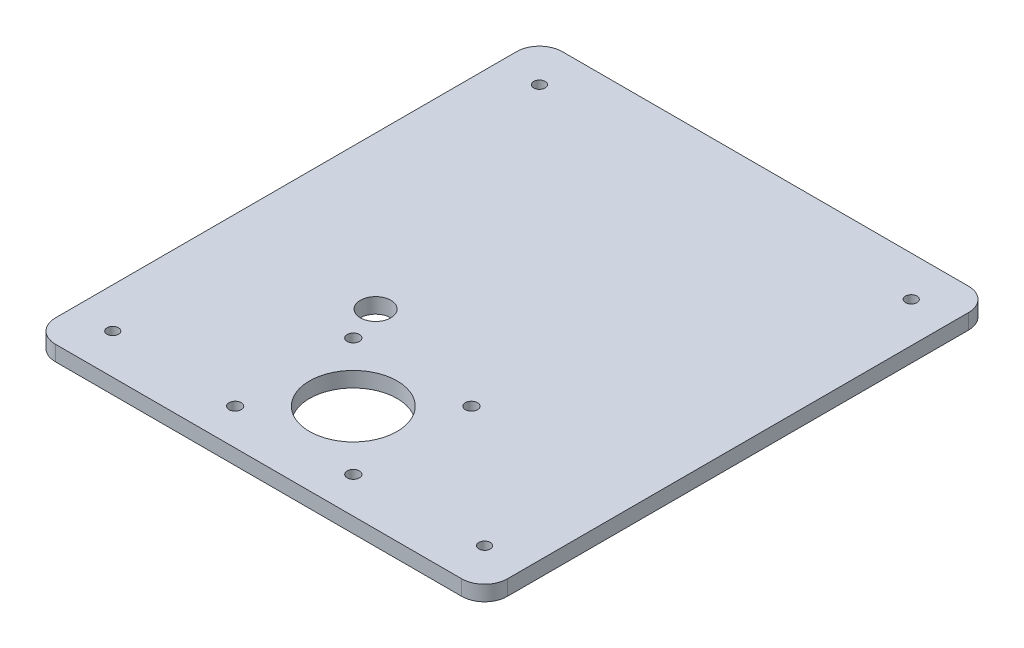
ISO-10303-21;
HEADER;
FILE_DESCRIPTION(('STEP AP214'),'2;1');
FILE_NAME('part.step','',(''),(''),'','','');
FILE_SCHEMA(('AUTOMOTIVE_DESIGN { 1 0 10303 214 1 1 1 1 }'));
ENDSEC;
DATA;
#1=APPLICATION_CONTEXT('core data for automotive mechanical design processes');
#2=APPLICATION_PROTOCOL_DEFINITION('international standard','automotive_design',2000,#1);
#3=PRODUCT_CONTEXT('',#1,'mechanical');
#4=PRODUCT('Part','Part','',(#3));
#5=PRODUCT_RELATED_PRODUCT_CATEGORY('part','',(#4));
#6=PRODUCT_DEFINITION_FORMATION('','',#4);
#7=PRODUCT_DEFINITION_CONTEXT('part definition',#1,'design');
#8=PRODUCT_DEFINITION('design','',#6,#7);
#9=PRODUCT_DEFINITION_SHAPE('','',#8);
#10=(LENGTH_UNIT() NAMED_UNIT(*) SI_UNIT(.MILLI.,.METRE.));
#11=(NAMED_UNIT(*) PLANE_ANGLE_UNIT() SI_UNIT($,.RADIAN.));
#12=(NAMED_UNIT(*) SI_UNIT($,.STERADIAN.) SOLID_ANGLE_UNIT());
#13=UNCERTAINTY_MEASURE_WITH_UNIT(LENGTH_MEASURE(1.E-05),#10,'distance_accuracy_value','');
#14=(GEOMETRIC_REPRESENTATION_CONTEXT(3) GLOBAL_UNCERTAINTY_ASSIGNED_CONTEXT((#13)) GLOBAL_UNIT_ASSIGNED_CONTEXT((#10,
#11,#12)) REPRESENTATION_CONTEXT('',''));
#15=CARTESIAN_POINT('',(0.,0.,0.));
#16=DIRECTION('',(0.,0.,1.));
#17=DIRECTION('',(1.,0.,0.));
#18=AXIS2_PLACEMENT_3D('',#15,#16,#17);
#19=CARTESIAN_POINT('',(111.074334450702,53.3961892872808,202.069099258539));
#20=DIRECTION('',(0.,-1.,0.));
#21=DIRECTION('',(0.,0.,-1.));
#22=AXIS2_PLACEMENT_3D('',#19,#20,#21);
#23=PLANE('',#22);
#24=CARTESIAN_POINT('',(38.4779917164948,53.3961892872808,158.072756524331));
#25=DIRECTION('',(0.,-1.,0.));
#26=DIRECTION('',(0.,0.,-1.));
#27=AXIS2_PLACEMENT_3D('',#24,#25,#26);
#28=CIRCLE('',#27,4.00000000000001);
#29=CARTESIAN_POINT('',(38.4779917164948,53.3961892872808,154.072756524331));
#30=VERTEX_POINT('',#29);
#31=EDGE_CURVE('E755',#30,#30,#28,.T.);
#32=ORIENTED_EDGE('',*,*,#31,.F.);
#33=EDGE_LOOP('',(#32));
#34=FACE_BOUND('',#33,.T.);
#35=CARTESIAN_POINT('',(53.9779917164948,53.3961892872808,161.572756524331));
#36=DIRECTION('',(0.,-1.,0.));
#37=DIRECTION('',(0.,0.,-1.));
#38=AXIS2_PLACEMENT_3D('',#35,#36,#37);
#39=CIRCLE('',#38,3.);
#40=CARTESIAN_POINT('',(53.9779917164948,53.3961892872808,164.572756524331));
#41=VERTEX_POINT('',#40);
#42=CARTESIAN_POINT('',(50.9779917164948,53.3961892872808,161.572756524331));
#43=VERTEX_POINT('',#42);
#44=EDGE_CURVE('E234',#41,#43,#39,.T.);
#45=ORIENTED_EDGE('',*,*,#44,.F.);
#46=DIRECTION('',(-1.,0.,0.));
#47=VECTOR('',#46,1.);
#48=CARTESIAN_POINT('',(111.074334450702,53.3961892872808,164.572756524331));
#49=LINE('',#48,#47);
#50=CARTESIAN_POINT('',(60.9779917164948,53.3961892872808,164.572756524331));
#51=VERTEX_POINT('',#50);
#52=EDGE_CURVE('E11',#41,#51,#49,.F.);
#53=ORIENTED_EDGE('',*,*,#52,.T.);
#54=CARTESIAN_POINT('',(60.9779917164948,53.3961892872808,161.572756524331));
#55=DIRECTION('',(0.,-1.,0.));
#56=DIRECTION('',(0.,0.,-1.));
#57=AXIS2_PLACEMENT_3D('',#54,#55,#56);
#58=CIRCLE('',#57,3.);
#59=CARTESIAN_POINT('',(63.9779917164948,53.3961892872808,161.572756524331));
#60=VERTEX_POINT('',#59);
#61=EDGE_CURVE('E42',#60,#51,#58,.T.);
#62=ORIENTED_EDGE('',*,*,#61,.F.);
#63=DIRECTION('',(0.,0.,1.));
#64=VECTOR('',#63,1.);
#65=CARTESIAN_POINT('',(63.9779917164948,53.3961892872808,202.069099258538));
#66=LINE('',#65,#64);
#67=CARTESIAN_POINT('',(63.9779917164948,53.3961892872808,134.572756524331));
#68=VERTEX_POINT('',#67);
#69=EDGE_CURVE('E247',#60,#68,#66,.F.);
#70=ORIENTED_EDGE('',*,*,#69,.T.);
#71=CARTESIAN_POINT('',(60.9779917164948,53.3961892872808,134.572756524331));
#72=DIRECTION('',(0.,-1.,0.));
#73=DIRECTION('',(0.,0.,-1.));
#74=AXIS2_PLACEMENT_3D('',#71,#72,#73);
#75=CIRCLE('',#74,3.);
#76=CARTESIAN_POINT('',(60.9779917164948,53.3961892872808,131.572756524331));
#77=VERTEX_POINT('',#76);
#78=EDGE_CURVE('E244',#77,#68,#75,.T.);
#79=ORIENTED_EDGE('',*,*,#78,.F.);
#80=DIRECTION('',(1.,0.,0.));
#81=VECTOR('',#80,1.);
#82=CARTESIAN_POINT('',(111.074334450702,53.3961892872808,131.572756524331));
#83=LINE('',#82,#81);
#84=CARTESIAN_POINT('',(53.9779917164948,53.3961892872808,131.572756524331));
#85=VERTEX_POINT('',#84);
#86=EDGE_CURVE('E242',#77,#85,#83,.F.);
#87=ORIENTED_EDGE('',*,*,#86,.T.);
#88=CARTESIAN_POINT('',(53.9779917164948,53.3961892872808,134.572756524331));
#89=DIRECTION('',(0.,-1.,0.));
#90=DIRECTION('',(0.,0.,-1.));
#91=AXIS2_PLACEMENT_3D('',#88,#89,#90);
#92=CIRCLE('',#91,3.);
#93=CARTESIAN_POINT('',(50.9779917164948,53.3961892872808,134.572756524331));
#94=VERTEX_POINT('',#93);
#95=EDGE_CURVE('E239',#94,#85,#92,.T.);
#96=ORIENTED_EDGE('',*,*,#95,.F.);
#97=DIRECTION('',(0.,0.,-1.));
#98=VECTOR('',#97,1.);
#99=CARTESIAN_POINT('',(50.9779917164948,53.3961892872808,202.069099258538));
#100=LINE('',#99,#98);
#101=EDGE_CURVE('E237',#94,#43,#100,.F.);
#102=ORIENTED_EDGE('',*,*,#101,.T.);
#103=EDGE_LOOP('',(#45,#53,#62,#70,#79,#87,#96,#102));
#104=FACE_BOUND('',#103,.T.);
#105=CARTESIAN_POINT('',(106.561867680193,53.3961892872808,197.556632488029));
#106=DIRECTION('',(0.,-1.,0.));
#107=DIRECTION('',(0.,0.,-1.));
#108=AXIS2_PLACEMENT_3D('',#105,#106,#107);
#109=CIRCLE('',#108,1.5);
#110=CARTESIAN_POINT('',(106.561867680193,53.3961892872808,196.056632488029));
#111=VERTEX_POINT('',#110);
#112=EDGE_CURVE('E312',#111,#111,#109,.T.);
#113=ORIENTED_EDGE('',*,*,#112,.F.);
#114=EDGE_LOOP('',(#113));
#115=FACE_BOUND('',#114,.T.);
#116=CARTESIAN_POINT('',(8.99411575279711,53.3961892872808,85.5888805606337));
#117=DIRECTION('',(0.,-1.,0.));
#118=DIRECTION('',(0.,0.,-1.));
#119=AXIS2_PLACEMENT_3D('',#116,#117,#118);
#120=CIRCLE('',#119,1.5);
#121=CARTESIAN_POINT('',(8.99411575279711,53.3961892872808,84.0888805606337));
#122=VERTEX_POINT('',#121);
#123=EDGE_CURVE('E311',#122,#122,#120,.T.);
#124=ORIENTED_EDGE('',*,*,#123,.F.);
#125=EDGE_LOOP('',(#124));
#126=FACE_BOUND('',#125,.T.);
#127=CARTESIAN_POINT('',(106.561867680193,53.3961892872808,85.5888805606337));
#128=DIRECTION('',(0.,-1.,0.));
#129=DIRECTION('',(0.,0.,-1.));
#130=AXIS2_PLACEMENT_3D('',#127,#128,#129);
#131=CIRCLE('',#130,1.5);
#132=CARTESIAN_POINT('',(106.561867680193,53.3961892872808,84.0888805606337));
#133=VERTEX_POINT('',#132);
#134=EDGE_CURVE('E305',#133,#133,#131,.T.);
#135=ORIENTED_EDGE('',*,*,#134,.F.);
#136=EDGE_LOOP('',(#135));
#137=FACE_BOUND('',#136,.T.);
#138=CARTESIAN_POINT('',(8.99411575279711,53.3961892872808,197.556632488029));
#139=DIRECTION('',(0.,-1.,0.));
#140=DIRECTION('',(0.,0.,-1.));
#141=AXIS2_PLACEMENT_3D('',#138,#139,#140);
#142=CIRCLE('',#141,1.5);
#143=CARTESIAN_POINT('',(8.99411575279711,53.3961892872808,196.056632488029));
#144=VERTEX_POINT('',#143);
#145=EDGE_CURVE('E319',#144,#144,#142,.T.);
#146=ORIENTED_EDGE('',*,*,#145,.F.);
#147=EDGE_LOOP('',(#146));
#148=FACE_BOUND('',#147,.T.);
#149=CARTESIAN_POINT('',(73.1312084616623,53.3961892872808,167.571537435734));
#150=DIRECTION('',(0.,-1.,0.));
#151=DIRECTION('',(0.,0.,-1.));
#152=AXIS2_PLACEMENT_3D('',#149,#150,#151);
#153=CIRCLE('',#152,1.59999999999999);
#154=CARTESIAN_POINT('',(73.1312084616623,53.3961892872808,165.971537435734));
#155=VERTEX_POINT('',#154);
#156=EDGE_CURVE('E329',#155,#155,#153,.T.);
#157=ORIENTED_EDGE('',*,*,#156,.F.);
#158=EDGE_LOOP('',(#157));
#159=FACE_BOUND('',#158,.T.);
#160=CARTESIAN_POINT('',(42.1312084616623,53.3961892872808,167.571537435734));
#161=DIRECTION('',(0.,-1.,0.));
#162=DIRECTION('',(0.,0.,-1.));
#163=AXIS2_PLACEMENT_3D('',#160,#161,#162);
#164=CIRCLE('',#163,1.59999999999999);
#165=CARTESIAN_POINT('',(42.1312084616623,53.3961892872808,165.971537435734));
#166=VERTEX_POINT('',#165);
#167=EDGE_CURVE('E344',#166,#166,#164,.T.);
#168=ORIENTED_EDGE('',*,*,#167,.F.);
#169=EDGE_LOOP('',(#168));
#170=FACE_BOUND('',#169,.T.);
#171=CARTESIAN_POINT('',(42.1312084616623,53.3961892872808,198.571537435734));
#172=DIRECTION('',(0.,-1.,0.));
#173=DIRECTION('',(0.,0.,-1.));
#174=AXIS2_PLACEMENT_3D('',#171,#172,#173);
#175=CIRCLE('',#174,1.59999999999999);
#176=CARTESIAN_POINT('',(42.1312084616623,53.3961892872808,196.971537435734));
#177=VERTEX_POINT('',#176);
#178=EDGE_CURVE('E338',#177,#177,#175,.T.);
#179=ORIENTED_EDGE('',*,*,#178,.F.);
#180=EDGE_LOOP('',(#179));
#181=FACE_BOUND('',#180,.T.);
#182=CARTESIAN_POINT('',(73.1312084616623,53.3961892872808,198.571537435734));
#183=DIRECTION('',(0.,-1.,0.));
#184=DIRECTION('',(0.,0.,-1.));
#185=AXIS2_PLACEMENT_3D('',#182,#183,#184);
#186=CIRCLE('',#185,1.59999999999999);
#187=CARTESIAN_POINT('',(73.1312084616623,53.3961892872808,196.971537435734));
#188=VERTEX_POINT('',#187);
#189=EDGE_CURVE('E330',#188,#188,#186,.T.);
#190=ORIENTED_EDGE('',*,*,#189,.F.);
#191=EDGE_LOOP('',(#190));
#192=FACE_BOUND('',#191,.T.);
#193=CARTESIAN_POINT('',(57.6312084616623,53.3961892872808,183.071537465536));
#194=DIRECTION('',(0.,-1.,0.));
#195=DIRECTION('',(0.,0.,-1.));
#196=AXIS2_PLACEMENT_3D('',#193,#194,#195);
#197=CIRCLE('',#196,11.5);
#198=CARTESIAN_POINT('',(57.6312084616623,53.3961892872808,171.571537465536));
#199=VERTEX_POINT('',#198);
#200=EDGE_CURVE('E337',#199,#199,#197,.T.);
#201=ORIENTED_EDGE('',*,*,#200,.F.);
#202=EDGE_LOOP('',(#201));
#203=FACE_BOUND('',#202,.T.);
#204=CARTESIAN_POINT('',(111.074334450702,53.3961892872808,202.069099258539));
#205=DIRECTION('',(0.,-1.,0.));
#206=DIRECTION('',(0.707106781186549,0.,0.707106781186546));
#207=AXIS2_PLACEMENT_3D('',#204,#205,#206);
#208=ELLIPSE('',#207,6.00731230503429,6.00000000000001);
#209=CARTESIAN_POINT('',(117.077991716495,53.3961892872808,202.076411562217));
#210=VERTEX_POINT('',#209);
#211=CARTESIAN_POINT('',(111.08164675438,53.3961892872808,208.072756524331));
#212=VERTEX_POINT('',#211);
#213=EDGE_CURVE('E183',#210,#212,#208,.T.);
#214=ORIENTED_EDGE('',*,*,#213,.T.);
#215=DIRECTION('',(-1.,0.,0.));
#216=VECTOR('',#215,1.);
#217=CARTESIAN_POINT('',(4.47433667860937,53.3961892872808,208.072756524331));
#218=LINE('',#217,#216);
#219=CARTESIAN_POINT('',(4.47433667860937,53.3961892872808,208.072756524331));
#220=VERTEX_POINT('',#219);
#221=EDGE_CURVE('E172',#212,#220,#218,.T.);
#222=ORIENTED_EDGE('',*,*,#221,.T.);
#223=CARTESIAN_POINT('',(4.48164898228774,53.3961892872808,202.069099258539));
#224=DIRECTION('',(0.,-1.,0.));
#225=DIRECTION('',(-0.707106781186548,0.,0.707106781186547));
#226=AXIS2_PLACEMENT_3D('',#223,#224,#225);
#227=ELLIPSE('',#226,6.00731230503429,6.00000000000001);
#228=CARTESIAN_POINT('',(-1.5220082835052,53.3961892872808,202.076411562217));
#229=VERTEX_POINT('',#228);
#230=EDGE_CURVE('E182',#220,#229,#227,.T.);
#231=ORIENTED_EDGE('',*,*,#230,.T.);
#232=DIRECTION('',(0.,0.,-1.));
#233=VECTOR('',#232,1.);
#234=CARTESIAN_POINT('',(-1.5220082835052,53.3961892872808,81.069101486446));
#235=LINE('',#234,#233);
#236=CARTESIAN_POINT('',(-1.5220082835052,53.3961892872808,81.069101486446));
#237=VERTEX_POINT('',#236);
#238=EDGE_CURVE('E476',#229,#237,#235,.T.);
#239=ORIENTED_EDGE('',*,*,#238,.T.);
#240=CARTESIAN_POINT('',(4.48164898228774,53.3961892872808,81.0764137901244));
#241=DIRECTION('',(0.,-1.,0.));
#242=DIRECTION('',(-0.707106781186547,0.,-0.707106781186548));
#243=AXIS2_PLACEMENT_3D('',#240,#241,#242);
#244=ELLIPSE('',#243,6.0073123050343,6.);
#245=CARTESIAN_POINT('',(4.47433667860938,53.3961892872808,75.0727565243314));
#246=VERTEX_POINT('',#245);
#247=EDGE_CURVE('E491',#237,#246,#244,.T.);
#248=ORIENTED_EDGE('',*,*,#247,.T.);
#249=DIRECTION('',(1.,0.,0.));
#250=VECTOR('',#249,1.);
#251=CARTESIAN_POINT('',(111.08164675438,53.3961892872808,75.0727565243314));
#252=LINE('',#251,#250);
#253=CARTESIAN_POINT('',(111.08164675438,53.3961892872808,75.0727565243314));
#254=VERTEX_POINT('',#253);
#255=EDGE_CURVE('E439',#246,#254,#252,.T.);
#256=ORIENTED_EDGE('',*,*,#255,.T.);
#257=CARTESIAN_POINT('',(111.074334450702,53.3961892872808,81.0764137901244));
#258=DIRECTION('',(0.,-1.,0.));
#259=DIRECTION('',(0.707106781186548,0.,-0.707106781186548));
#260=AXIS2_PLACEMENT_3D('',#257,#258,#259);
#261=ELLIPSE('',#260,6.0073123050343,6.);
#262=CARTESIAN_POINT('',(117.077991716495,53.3961892872808,81.069101486446));
#263=VERTEX_POINT('',#262);
#264=EDGE_CURVE('E435',#254,#263,#261,.T.);
#265=ORIENTED_EDGE('',*,*,#264,.T.);
#266=DIRECTION('',(0.,0.,1.));
#267=VECTOR('',#266,1.);
#268=CARTESIAN_POINT('',(117.077991716495,53.3961892872808,202.076411562217));
#269=LINE('',#268,#267);
#270=EDGE_CURVE('E187',#263,#210,#269,.T.);
#271=ORIENTED_EDGE('',*,*,#270,.T.);
#272=EDGE_LOOP('',(#214,#222,#231,#239,#248,#256,#265,#271));
#273=FACE_BOUND('',#272,.T.);
#274=ADVANCED_FACE('F33',(#34,#104,#115,#126,#137,#148,#159,#170,#181,#192,#203,#273),#23,.T.);
#275=DIRECTION('',(0.,1.,0.));
#276=VECTOR('',#275,1.);
#277=SURFACE_OF_LINEAR_EXTRUSION('',#208,#276);
#278=CARTESIAN_POINT('',(111.074334450702,57.3961892872808,202.069099258539));
#279=DIRECTION('',(0.,-1.,0.));
#280=DIRECTION('',(0.707106781186549,0.,0.707106781186546));
#281=AXIS2_PLACEMENT_3D('',#278,#279,#280);
#282=ELLIPSE('',#281,6.00731230503429,6.00000000000001);
#283=CARTESIAN_POINT('',(117.077991716495,57.3961892872808,202.076411562217));
#284=VERTEX_POINT('',#283);
#285=CARTESIAN_POINT('',(111.08164675438,57.3961892872808,208.072756524331));
#286=VERTEX_POINT('',#285);
#287=EDGE_CURVE('E195',#284,#286,#282,.T.);
#288=ORIENTED_EDGE('',*,*,#287,.T.);
#289=DIRECTION('',(0.,1.,0.));
#290=VECTOR('',#289,1.);
#291=CARTESIAN_POINT('',(111.08164675438,53.3961892872808,208.072756524331));
#292=LINE('',#291,#290);
#293=EDGE_CURVE('E176',#212,#286,#292,.T.);
#294=ORIENTED_EDGE('',*,*,#293,.F.);
#295=ORIENTED_EDGE('',*,*,#213,.F.);
#296=DIRECTION('',(0.,1.,0.));
#297=VECTOR('',#296,1.);
#298=CARTESIAN_POINT('',(117.077991716495,53.3961892872808,202.076411562217));
#299=LINE('',#298,#297);
#300=EDGE_CURVE('E442',#210,#284,#299,.T.);
#301=ORIENTED_EDGE('',*,*,#300,.T.);
#302=EDGE_LOOP('',(#288,#294,#295,#301));
#303=FACE_BOUND('',#302,.T.);
#304=ADVANCED_FACE('F193',(#303),#277,.F.);
#305=CARTESIAN_POINT('',(4.47433667860937,53.3961892872808,208.072756524331));
#306=DIRECTION('',(0.,0.,-1.));
#307=DIRECTION('',(-1.,0.,0.));
#308=AXIS2_PLACEMENT_3D('',#305,#306,#307);
#309=PLANE('',#308);
#310=DIRECTION('',(-1.,0.,0.));
#311=VECTOR('',#310,1.);
#312=CARTESIAN_POINT('',(4.47433667860937,57.3961892872808,208.072756524331));
#313=LINE('',#312,#311);
#314=CARTESIAN_POINT('',(4.47433667860937,57.3961892872808,208.072756524331));
#315=VERTEX_POINT('',#314);
#316=EDGE_CURVE('E444',#286,#315,#313,.T.);
#317=ORIENTED_EDGE('',*,*,#316,.T.);
#318=DIRECTION('',(0.,1.,0.));
#319=VECTOR('',#318,1.);
#320=CARTESIAN_POINT('',(4.47433667860937,53.3961892872808,208.072756524331));
#321=LINE('',#320,#319);
#322=EDGE_CURVE('E179',#220,#315,#321,.T.);
#323=ORIENTED_EDGE('',*,*,#322,.F.);
#324=ORIENTED_EDGE('',*,*,#221,.F.);
#325=ORIENTED_EDGE('',*,*,#293,.T.);
#326=EDGE_LOOP('',(#317,#323,#324,#325));
#327=FACE_BOUND('',#326,.T.);
#328=ADVANCED_FACE('F174',(#327),#309,.F.);
#329=DIRECTION('',(0.,1.,0.));
#330=VECTOR('',#329,1.);
#331=SURFACE_OF_LINEAR_EXTRUSION('',#227,#330);
#332=CARTESIAN_POINT('',(4.48164898228774,57.3961892872808,202.069099258539));
#333=DIRECTION('',(0.,-1.,0.));
#334=DIRECTION('',(-0.707106781186548,0.,0.707106781186547));
#335=AXIS2_PLACEMENT_3D('',#332,#333,#334);
#336=ELLIPSE('',#335,6.00731230503429,6.00000000000001);
#337=CARTESIAN_POINT('',(-1.5220082835052,57.3961892872808,202.076411562217));
#338=VERTEX_POINT('',#337);
#339=EDGE_CURVE('E446',#315,#338,#336,.T.);
#340=ORIENTED_EDGE('',*,*,#339,.T.);
#341=DIRECTION('',(0.,1.,0.));
#342=VECTOR('',#341,1.);
#343=CARTESIAN_POINT('',(-1.5220082835052,53.3961892872808,202.076411562217));
#344=LINE('',#343,#342);
#345=EDGE_CURVE('E200',#229,#338,#344,.T.);
#346=ORIENTED_EDGE('',*,*,#345,.F.);
#347=ORIENTED_EDGE('',*,*,#230,.F.);
#348=ORIENTED_EDGE('',*,*,#322,.T.);
#349=EDGE_LOOP('',(#340,#346,#347,#348));
#350=FACE_BOUND('',#349,.T.);
#351=ADVANCED_FACE('F497',(#350),#331,.F.);
#352=CARTESIAN_POINT('',(-1.5220082835052,53.3961892872808,81.069101486446));
#353=DIRECTION('',(1.,0.,0.));
#354=DIRECTION('',(0.,0.,-1.));
#355=AXIS2_PLACEMENT_3D('',#352,#353,#354);
#356=PLANE('',#355);
#357=DIRECTION('',(0.,0.,-1.));
#358=VECTOR('',#357,1.);
#359=CARTESIAN_POINT('',(-1.5220082835052,57.3961892872808,81.069101486446));
#360=LINE('',#359,#358);
#361=CARTESIAN_POINT('',(-1.5220082835052,57.3961892872808,81.069101486446));
#362=VERTEX_POINT('',#361);
#363=EDGE_CURVE('E448',#338,#362,#360,.T.);
#364=ORIENTED_EDGE('',*,*,#363,.T.);
#365=DIRECTION('',(0.,1.,0.));
#366=VECTOR('',#365,1.);
#367=CARTESIAN_POINT('',(-1.5220082835052,53.3961892872808,81.069101486446));
#368=LINE('',#367,#366);
#369=EDGE_CURVE('E467',#237,#362,#368,.T.);
#370=ORIENTED_EDGE('',*,*,#369,.F.);
#371=ORIENTED_EDGE('',*,*,#238,.F.);
#372=ORIENTED_EDGE('',*,*,#345,.T.);
#373=EDGE_LOOP('',(#364,#370,#371,#372));
#374=FACE_BOUND('',#373,.T.);
#375=ADVANCED_FACE('F474',(#374),#356,.F.);
#376=DIRECTION('',(0.,1.,0.));
#377=VECTOR('',#376,1.);
#378=SURFACE_OF_LINEAR_EXTRUSION('',#244,#377);
#379=CARTESIAN_POINT('',(4.48164898228774,57.3961892872808,81.0764137901244));
#380=DIRECTION('',(0.,-1.,0.));
#381=DIRECTION('',(-0.707106781186547,0.,-0.707106781186548));
#382=AXIS2_PLACEMENT_3D('',#379,#380,#381);
#383=ELLIPSE('',#382,6.0073123050343,6.);
#384=CARTESIAN_POINT('',(4.47433667860938,57.3961892872808,75.0727565243314));
#385=VERTEX_POINT('',#384);
#386=EDGE_CURVE('E450',#362,#385,#383,.T.);
#387=ORIENTED_EDGE('',*,*,#386,.T.);
#388=DIRECTION('',(0.,1.,0.));
#389=VECTOR('',#388,1.);
#390=CARTESIAN_POINT('',(4.47433667860938,53.3961892872808,75.0727565243314));
#391=LINE('',#390,#389);
#392=EDGE_CURVE('E464',#246,#385,#391,.T.);
#393=ORIENTED_EDGE('',*,*,#392,.F.);
#394=ORIENTED_EDGE('',*,*,#247,.F.);
#395=ORIENTED_EDGE('',*,*,#369,.T.);
#396=EDGE_LOOP('',(#387,#393,#394,#395));
#397=FACE_BOUND('',#396,.T.);
#398=ADVANCED_FACE('F485',(#397),#378,.F.);
#399=CARTESIAN_POINT('',(111.08164675438,53.3961892872808,75.0727565243314));
#400=DIRECTION('',(0.,0.,1.));
#401=DIRECTION('',(1.,0.,0.));
#402=AXIS2_PLACEMENT_3D('',#399,#400,#401);
#403=PLANE('',#402);
#404=DIRECTION('',(1.,0.,0.));
#405=VECTOR('',#404,1.);
#406=CARTESIAN_POINT('',(111.08164675438,57.3961892872808,75.0727565243314));
#407=LINE('',#406,#405);
#408=CARTESIAN_POINT('',(111.08164675438,57.3961892872808,75.0727565243314));
#409=VERTEX_POINT('',#408);
#410=EDGE_CURVE('E452',#385,#409,#407,.T.);
#411=ORIENTED_EDGE('',*,*,#410,.T.);
#412=DIRECTION('',(0.,1.,0.));
#413=VECTOR('',#412,1.);
#414=CARTESIAN_POINT('',(111.08164675438,53.3961892872808,75.0727565243314));
#415=LINE('',#414,#413);
#416=EDGE_CURVE('E461',#254,#409,#415,.T.);
#417=ORIENTED_EDGE('',*,*,#416,.F.);
#418=ORIENTED_EDGE('',*,*,#255,.F.);
#419=ORIENTED_EDGE('',*,*,#392,.T.);
#420=EDGE_LOOP('',(#411,#417,#418,#419));
#421=FACE_BOUND('',#420,.T.);
#422=ADVANCED_FACE('F432',(#421),#403,.F.);
#423=DIRECTION('',(0.,1.,0.));
#424=VECTOR('',#423,1.);
#425=SURFACE_OF_LINEAR_EXTRUSION('',#261,#424);
#426=CARTESIAN_POINT('',(111.074334450702,57.3961892872808,81.0764137901244));
#427=DIRECTION('',(0.,-1.,0.));
#428=DIRECTION('',(0.707106781186548,0.,-0.707106781186548));
#429=AXIS2_PLACEMENT_3D('',#426,#427,#428);
#430=ELLIPSE('',#429,6.0073123050343,6.);
#431=CARTESIAN_POINT('',(117.077991716495,57.3961892872808,81.069101486446));
#432=VERTEX_POINT('',#431);
#433=EDGE_CURVE('E454',#409,#432,#430,.T.);
#434=ORIENTED_EDGE('',*,*,#433,.T.);
#435=DIRECTION('',(0.,1.,0.));
#436=VECTOR('',#435,1.);
#437=CARTESIAN_POINT('',(117.077991716495,53.3961892872808,81.069101486446));
#438=LINE('',#437,#436);
#439=EDGE_CURVE('E458',#263,#432,#438,.T.);
#440=ORIENTED_EDGE('',*,*,#439,.F.);
#441=ORIENTED_EDGE('',*,*,#264,.F.);
#442=ORIENTED_EDGE('',*,*,#416,.T.);
#443=EDGE_LOOP('',(#434,#440,#441,#442));
#444=FACE_BOUND('',#443,.T.);
#445=ADVANCED_FACE('F427',(#444),#425,.F.);
#446=CARTESIAN_POINT('',(117.077991716495,53.3961892872808,202.076411562217));
#447=DIRECTION('',(-1.,0.,0.));
#448=DIRECTION('',(0.,0.,1.));
#449=AXIS2_PLACEMENT_3D('',#446,#447,#448);
#450=PLANE('',#449);
#451=DIRECTION('',(0.,0.,1.));
#452=VECTOR('',#451,1.);
#453=CARTESIAN_POINT('',(117.077991716495,57.3961892872808,202.076411562217));
#454=LINE('',#453,#452);
#455=EDGE_CURVE('E191',#432,#284,#454,.T.);
#456=ORIENTED_EDGE('',*,*,#455,.T.);
#457=ORIENTED_EDGE('',*,*,#300,.F.);
#458=ORIENTED_EDGE('',*,*,#270,.F.);
#459=ORIENTED_EDGE('',*,*,#439,.T.);
#460=EDGE_LOOP('',(#456,#457,#458,#459));
#461=FACE_BOUND('',#460,.T.);
#462=ADVANCED_FACE('F423',(#461),#450,.F.);
#463=CARTESIAN_POINT('',(111.074334450702,57.3961892872808,202.069099258539));
#464=DIRECTION('',(0.,-1.,0.));
#465=DIRECTION('',(0.,0.,-1.));
#466=AXIS2_PLACEMENT_3D('',#463,#464,#465);
#467=PLANE('',#466);
#468=CARTESIAN_POINT('',(38.4779917164948,57.3961892872808,158.072756524331));
#469=DIRECTION('',(0.,-1.,0.));
#470=DIRECTION('',(0.,0.,-1.));
#471=AXIS2_PLACEMENT_3D('',#468,#469,#470);
#472=CIRCLE('',#471,4.00000000000001);
#473=CARTESIAN_POINT('',(38.4779917164948,57.3961892872808,154.072756524331));
#474=VERTEX_POINT('',#473);
#475=EDGE_CURVE('E253',#474,#474,#472,.F.);
#476=ORIENTED_EDGE('',*,*,#475,.F.);
#477=EDGE_LOOP('',(#476));
#478=FACE_BOUND('',#477,.T.);
#479=CARTESIAN_POINT('',(106.561867680193,57.3961892872808,197.556632488029));
#480=DIRECTION('',(0.,-1.,0.));
#481=DIRECTION('',(0.,0.,-1.));
#482=AXIS2_PLACEMENT_3D('',#479,#480,#481);
#483=CIRCLE('',#482,1.5);
#484=CARTESIAN_POINT('',(106.561867680193,57.3961892872808,196.056632488029));
#485=VERTEX_POINT('',#484);
#486=EDGE_CURVE('E315',#485,#485,#483,.F.);
#487=ORIENTED_EDGE('',*,*,#486,.F.);
#488=EDGE_LOOP('',(#487));
#489=FACE_BOUND('',#488,.T.);
#490=CARTESIAN_POINT('',(8.99411575279711,57.3961892872808,85.5888805606337));
#491=DIRECTION('',(0.,-1.,0.));
#492=DIRECTION('',(0.,0.,-1.));
#493=AXIS2_PLACEMENT_3D('',#490,#491,#492);
#494=CIRCLE('',#493,1.5);
#495=CARTESIAN_POINT('',(8.99411575279711,57.3961892872808,84.0888805606337));
#496=VERTEX_POINT('',#495);
#497=EDGE_CURVE('E316',#496,#496,#494,.F.);
#498=ORIENTED_EDGE('',*,*,#497,.F.);
#499=EDGE_LOOP('',(#498));
#500=FACE_BOUND('',#499,.T.);
#501=CARTESIAN_POINT('',(106.561867680193,57.3961892872808,85.5888805606337));
#502=DIRECTION('',(0.,-1.,0.));
#503=DIRECTION('',(0.,0.,-1.));
#504=AXIS2_PLACEMENT_3D('',#501,#502,#503);
#505=CIRCLE('',#504,1.5);
#506=CARTESIAN_POINT('',(106.561867680193,57.3961892872808,84.0888805606337));
#507=VERTEX_POINT('',#506);
#508=EDGE_CURVE('E308',#507,#507,#505,.F.);
#509=ORIENTED_EDGE('',*,*,#508,.F.);
#510=EDGE_LOOP('',(#509));
#511=FACE_BOUND('',#510,.T.);
#512=CARTESIAN_POINT('',(8.99411575279711,57.3961892872808,197.556632488029));
#513=DIRECTION('',(0.,-1.,0.));
#514=DIRECTION('',(0.,0.,-1.));
#515=AXIS2_PLACEMENT_3D('',#512,#513,#514);
#516=CIRCLE('',#515,1.5);
#517=CARTESIAN_POINT('',(8.99411575279711,57.3961892872808,196.056632488029));
#518=VERTEX_POINT('',#517);
#519=EDGE_CURVE('E326',#518,#518,#516,.F.);
#520=ORIENTED_EDGE('',*,*,#519,.F.);
#521=EDGE_LOOP('',(#520));
#522=FACE_BOUND('',#521,.T.);
#523=CARTESIAN_POINT('',(73.1312084616623,57.3961892872808,167.571537435734));
#524=DIRECTION('',(0.,-1.,0.));
#525=DIRECTION('',(0.,0.,-1.));
#526=AXIS2_PLACEMENT_3D('',#523,#524,#525);
#527=CIRCLE('',#526,1.59999999999999);
#528=CARTESIAN_POINT('',(73.1312084616623,57.3961892872808,165.971537435734));
#529=VERTEX_POINT('',#528);
#530=EDGE_CURVE('E347',#529,#529,#527,.F.);
#531=ORIENTED_EDGE('',*,*,#530,.F.);
#532=EDGE_LOOP('',(#531));
#533=FACE_BOUND('',#532,.T.);
#534=CARTESIAN_POINT('',(42.1312084616623,57.3961892872808,167.571537435734));
#535=DIRECTION('',(0.,-1.,0.));
#536=DIRECTION('',(0.,0.,-1.));
#537=AXIS2_PLACEMENT_3D('',#534,#535,#536);
#538=CIRCLE('',#537,1.59999999999999);
#539=CARTESIAN_POINT('',(42.1312084616623,57.3961892872808,165.971537435734));
#540=VERTEX_POINT('',#539);
#541=EDGE_CURVE('E341',#540,#540,#538,.F.);
#542=ORIENTED_EDGE('',*,*,#541,.F.);
#543=EDGE_LOOP('',(#542));
#544=FACE_BOUND('',#543,.T.);
#545=CARTESIAN_POINT('',(42.1312084616623,57.3961892872808,198.571537435734));
#546=DIRECTION('',(0.,-1.,0.));
#547=DIRECTION('',(0.,0.,-1.));
#548=AXIS2_PLACEMENT_3D('',#545,#546,#547);
#549=CIRCLE('',#548,1.59999999999999);
#550=CARTESIAN_POINT('',(42.1312084616623,57.3961892872808,196.971537435734));
#551=VERTEX_POINT('',#550);
#552=EDGE_CURVE('E334',#551,#551,#549,.F.);
#553=ORIENTED_EDGE('',*,*,#552,.F.);
#554=EDGE_LOOP('',(#553));
#555=FACE_BOUND('',#554,.T.);
#556=CARTESIAN_POINT('',(73.1312084616623,57.3961892872808,198.571537435734));
#557=DIRECTION('',(0.,-1.,0.));
#558=DIRECTION('',(0.,0.,-1.));
#559=AXIS2_PLACEMENT_3D('',#556,#557,#558);
#560=CIRCLE('',#559,1.59999999999999);
#561=CARTESIAN_POINT('',(73.1312084616623,57.3961892872808,196.971537435734));
#562=VERTEX_POINT('',#561);
#563=EDGE_CURVE('E333',#562,#562,#560,.F.);
#564=ORIENTED_EDGE('',*,*,#563,.F.);
#565=EDGE_LOOP('',(#564));
#566=FACE_BOUND('',#565,.T.);
#567=CARTESIAN_POINT('',(57.6312084616623,57.3961892872808,183.071537465536));
#568=DIRECTION('',(0.,-1.,0.));
#569=DIRECTION('',(0.,0.,-1.));
#570=AXIS2_PLACEMENT_3D('',#567,#568,#569);
#571=CIRCLE('',#570,11.5);
#572=CARTESIAN_POINT('',(57.6312084616623,57.3961892872808,171.571537465536));
#573=VERTEX_POINT('',#572);
#574=EDGE_CURVE('E356',#573,#573,#571,.F.);
#575=ORIENTED_EDGE('',*,*,#574,.F.);
#576=EDGE_LOOP('',(#575));
#577=FACE_BOUND('',#576,.T.);
#578=ORIENTED_EDGE('',*,*,#287,.F.);
#579=ORIENTED_EDGE('',*,*,#455,.F.);
#580=ORIENTED_EDGE('',*,*,#433,.F.);
#581=ORIENTED_EDGE('',*,*,#410,.F.);
#582=ORIENTED_EDGE('',*,*,#386,.F.);
#583=ORIENTED_EDGE('',*,*,#363,.F.);
#584=ORIENTED_EDGE('',*,*,#339,.F.);
#585=ORIENTED_EDGE('',*,*,#316,.F.);
#586=EDGE_LOOP('',(#578,#579,#580,#581,#582,#583,#584,#585));
#587=FACE_BOUND('',#586,.T.);
#588=ADVANCED_FACE('F420',(#478,#489,#500,#511,#522,#533,#544,#555,#566,#577,#587),#467,.F.);
#589=CARTESIAN_POINT('',(57.6312084616623,57.3971892872808,183.071537465536));
#590=DIRECTION('',(0.,-1.,0.));
#591=DIRECTION('',(0.,0.,-1.));
#592=AXIS2_PLACEMENT_3D('',#589,#590,#591);
#593=CYLINDRICAL_SURFACE('',#592,11.5);
#594=ORIENTED_EDGE('',*,*,#200,.T.);
#595=EDGE_LOOP('',(#594));
#596=FACE_BOUND('',#595,.T.);
#597=ORIENTED_EDGE('',*,*,#574,.T.);
#598=EDGE_LOOP('',(#597));
#599=FACE_BOUND('',#598,.T.);
#600=ADVANCED_FACE('F418',(#596,#599),#593,.F.);
#601=CARTESIAN_POINT('',(73.1312084616623,57.3971892872808,198.571537435734));
#602=DIRECTION('',(0.,-1.,0.));
#603=DIRECTION('',(0.,0.,-1.));
#604=AXIS2_PLACEMENT_3D('',#601,#602,#603);
#605=CYLINDRICAL_SURFACE('',#604,1.59999999999999);
#606=ORIENTED_EDGE('',*,*,#189,.T.);
#607=EDGE_LOOP('',(#606));
#608=FACE_BOUND('',#607,.T.);
#609=ORIENTED_EDGE('',*,*,#563,.T.);
#610=EDGE_LOOP('',(#609));
#611=FACE_BOUND('',#610,.T.);
#612=ADVANCED_FACE('F557',(#608,#611),#605,.F.);
#613=CARTESIAN_POINT('',(42.1312084616623,57.3971892872808,198.571537435734));
#614=DIRECTION('',(0.,-1.,0.));
#615=DIRECTION('',(0.,0.,-1.));
#616=AXIS2_PLACEMENT_3D('',#613,#614,#615);
#617=CYLINDRICAL_SURFACE('',#616,1.59999999999999);
#618=ORIENTED_EDGE('',*,*,#178,.T.);
#619=EDGE_LOOP('',(#618));
#620=FACE_BOUND('',#619,.T.);
#621=ORIENTED_EDGE('',*,*,#552,.T.);
#622=EDGE_LOOP('',(#621));
#623=FACE_BOUND('',#622,.T.);
#624=ADVANCED_FACE('F565',(#620,#623),#617,.F.);
#625=CARTESIAN_POINT('',(42.1312084616623,57.3971892872808,167.571537435734));
#626=DIRECTION('',(0.,-1.,0.));
#627=DIRECTION('',(0.,0.,-1.));
#628=AXIS2_PLACEMENT_3D('',#625,#626,#627);
#629=CYLINDRICAL_SURFACE('',#628,1.59999999999999);
#630=ORIENTED_EDGE('',*,*,#167,.T.);
#631=EDGE_LOOP('',(#630));
#632=FACE_BOUND('',#631,.T.);
#633=ORIENTED_EDGE('',*,*,#541,.T.);
#634=EDGE_LOOP('',(#633));
#635=FACE_BOUND('',#634,.T.);
#636=ADVANCED_FACE('F574',(#632,#635),#629,.F.);
#637=CARTESIAN_POINT('',(73.1312084616623,57.3971892872808,167.571537435734));
#638=DIRECTION('',(0.,-1.,0.));
#639=DIRECTION('',(0.,0.,-1.));
#640=AXIS2_PLACEMENT_3D('',#637,#638,#639);
#641=CYLINDRICAL_SURFACE('',#640,1.59999999999999);
#642=ORIENTED_EDGE('',*,*,#156,.T.);
#643=EDGE_LOOP('',(#642));
#644=FACE_BOUND('',#643,.T.);
#645=ORIENTED_EDGE('',*,*,#530,.T.);
#646=EDGE_LOOP('',(#645));
#647=FACE_BOUND('',#646,.T.);
#648=ADVANCED_FACE('F583',(#644,#647),#641,.F.);
#649=CARTESIAN_POINT('',(8.99411575279711,57.3971892872808,197.556632488029));
#650=DIRECTION('',(0.,-1.,0.));
#651=DIRECTION('',(0.,0.,-1.));
#652=AXIS2_PLACEMENT_3D('',#649,#650,#651);
#653=CYLINDRICAL_SURFACE('',#652,1.5);
#654=ORIENTED_EDGE('',*,*,#145,.T.);
#655=EDGE_LOOP('',(#654));
#656=FACE_BOUND('',#655,.T.);
#657=ORIENTED_EDGE('',*,*,#519,.T.);
#658=EDGE_LOOP('',(#657));
#659=FACE_BOUND('',#658,.T.);
#660=ADVANCED_FACE('F592',(#656,#659),#653,.F.);
#661=CARTESIAN_POINT('',(106.561867680193,57.3971892872808,85.5888805606337));
#662=DIRECTION('',(0.,-1.,0.));
#663=DIRECTION('',(0.,0.,-1.));
#664=AXIS2_PLACEMENT_3D('',#661,#662,#663);
#665=CYLINDRICAL_SURFACE('',#664,1.5);
#666=ORIENTED_EDGE('',*,*,#134,.T.);
#667=EDGE_LOOP('',(#666));
#668=FACE_BOUND('',#667,.T.);
#669=ORIENTED_EDGE('',*,*,#508,.T.);
#670=EDGE_LOOP('',(#669));
#671=FACE_BOUND('',#670,.T.);
#672=ADVANCED_FACE('F600',(#668,#671),#665,.F.);
#673=CARTESIAN_POINT('',(8.99411575279711,57.3971892872808,85.5888805606337));
#674=DIRECTION('',(0.,-1.,0.));
#675=DIRECTION('',(0.,0.,-1.));
#676=AXIS2_PLACEMENT_3D('',#673,#674,#675);
#677=CYLINDRICAL_SURFACE('',#676,1.5);
#678=ORIENTED_EDGE('',*,*,#123,.T.);
#679=EDGE_LOOP('',(#678));
#680=FACE_BOUND('',#679,.T.);
#681=ORIENTED_EDGE('',*,*,#497,.T.);
#682=EDGE_LOOP('',(#681));
#683=FACE_BOUND('',#682,.T.);
#684=ADVANCED_FACE('F609',(#680,#683),#677,.F.);
#685=CARTESIAN_POINT('',(106.561867680193,57.3971892872808,197.556632488029));
#686=DIRECTION('',(0.,-1.,0.));
#687=DIRECTION('',(0.,0.,-1.));
#688=AXIS2_PLACEMENT_3D('',#685,#686,#687);
#689=CYLINDRICAL_SURFACE('',#688,1.5);
#690=ORIENTED_EDGE('',*,*,#112,.T.);
#691=EDGE_LOOP('',(#690));
#692=FACE_BOUND('',#691,.T.);
#693=ORIENTED_EDGE('',*,*,#486,.T.);
#694=EDGE_LOOP('',(#693));
#695=FACE_BOUND('',#694,.T.);
#696=ADVANCED_FACE('F618',(#692,#695),#689,.F.);
#697=CARTESIAN_POINT('',(52.4779917164948,41.3961892872808,163.072756524331));
#698=DIRECTION('',(1.,0.,0.));
#699=DIRECTION('',(0.,0.,-1.));
#700=AXIS2_PLACEMENT_3D('',#697,#698,#699);
#701=PLANE('',#700);
#702=DIRECTION('',(0.,0.,-1.));
#703=VECTOR('',#702,1.);
#704=CARTESIAN_POINT('',(52.4779917164948,41.3961892872808,163.072756524331));
#705=LINE('',#704,#703);
#706=CARTESIAN_POINT('',(52.4779917164948,41.3961892872808,161.572756524331));
#707=VERTEX_POINT('',#706);
#708=CARTESIAN_POINT('',(52.4779917164948,41.3961892872808,134.572756524331));
#709=VERTEX_POINT('',#708);
#710=EDGE_CURVE('E284',#707,#709,#705,.T.);
#711=ORIENTED_EDGE('',*,*,#710,.F.);
#712=DIRECTION('',(0.,1.,0.));
#713=VECTOR('',#712,1.);
#714=CARTESIAN_POINT('',(52.4779917164948,41.3961892872808,161.572756524331));
#715=LINE('',#714,#713);
#716=CARTESIAN_POINT('',(52.4779917164948,51.8961892872808,161.572756524331));
#717=VERTEX_POINT('',#716);
#718=EDGE_CURVE('E205',#707,#717,#715,.T.);
#719=ORIENTED_EDGE('',*,*,#718,.T.);
#720=DIRECTION('',(0.,0.,-1.));
#721=VECTOR('',#720,1.);
#722=CARTESIAN_POINT('',(52.4779917164948,51.8961892872808,163.072756524331));
#723=LINE('',#722,#721);
#724=CARTESIAN_POINT('',(52.4779917164948,51.8961892872808,134.572756524331));
#725=VERTEX_POINT('',#724);
#726=EDGE_CURVE('E196',#717,#725,#723,.T.);
#727=ORIENTED_EDGE('',*,*,#726,.T.);
#728=DIRECTION('',(0.,1.,0.));
#729=VECTOR('',#728,1.);
#730=CARTESIAN_POINT('',(52.4779917164948,41.3961892872808,134.572756524331));
#731=LINE('',#730,#729);
#732=EDGE_CURVE('E198',#725,#709,#731,.F.);
#733=ORIENTED_EDGE('',*,*,#732,.T.);
#734=EDGE_LOOP('',(#711,#719,#727,#733));
#735=FACE_BOUND('',#734,.T.);
#736=ADVANCED_FACE('F627',(#735),#701,.F.);
#737=CARTESIAN_POINT('',(52.4779917164948,41.3961892872808,133.072756524331));
#738=DIRECTION('',(0.,0.,1.));
#739=DIRECTION('',(1.,0.,0.));
#740=AXIS2_PLACEMENT_3D('',#737,#738,#739);
#741=PLANE('',#740);
#742=DIRECTION('',(1.,0.,0.));
#743=VECTOR('',#742,1.);
#744=CARTESIAN_POINT('',(52.4779917164948,51.8961892872808,133.072756524331));
#745=LINE('',#744,#743);
#746=CARTESIAN_POINT('',(53.9779917164948,51.8961892872808,133.072756524331));
#747=VERTEX_POINT('',#746);
#748=CARTESIAN_POINT('',(60.9779917164948,51.8961892872808,133.072756524331));
#749=VERTEX_POINT('',#748);
#750=EDGE_CURVE('E228',#747,#749,#745,.T.);
#751=ORIENTED_EDGE('',*,*,#750,.T.);
#752=DIRECTION('',(0.,1.,0.));
#753=VECTOR('',#752,1.);
#754=CARTESIAN_POINT('',(60.9779917164948,41.3961892872808,133.072756524331));
#755=LINE('',#754,#753);
#756=CARTESIAN_POINT('',(60.9779917164948,41.3961892872808,133.072756524331));
#757=VERTEX_POINT('',#756);
#758=EDGE_CURVE('E232',#749,#757,#755,.F.);
#759=ORIENTED_EDGE('',*,*,#758,.T.);
#760=DIRECTION('',(1.,0.,0.));
#761=VECTOR('',#760,1.);
#762=CARTESIAN_POINT('',(52.4779917164948,41.3961892872808,133.072756524331));
#763=LINE('',#762,#761);
#764=CARTESIAN_POINT('',(53.9779917164948,41.3961892872808,133.072756524331));
#765=VERTEX_POINT('',#764);
#766=EDGE_CURVE('E289',#765,#757,#763,.T.);
#767=ORIENTED_EDGE('',*,*,#766,.F.);
#768=DIRECTION('',(0.,1.,0.));
#769=VECTOR('',#768,1.);
#770=CARTESIAN_POINT('',(53.9779917164948,41.3961892872808,133.072756524331));
#771=LINE('',#770,#769);
#772=EDGE_CURVE('E230',#765,#747,#771,.T.);
#773=ORIENTED_EDGE('',*,*,#772,.T.);
#774=EDGE_LOOP('',(#751,#759,#767,#773));
#775=FACE_BOUND('',#774,.T.);
#776=ADVANCED_FACE('F641',(#775),#741,.F.);
#777=CARTESIAN_POINT('',(62.4779917164948,41.3961892872808,163.072756524331));
#778=DIRECTION('',(-1.,0.,0.));
#779=DIRECTION('',(0.,0.,1.));
#780=AXIS2_PLACEMENT_3D('',#777,#778,#779);
#781=PLANE('',#780);
#782=DIRECTION('',(0.,0.,1.));
#783=VECTOR('',#782,1.);
#784=CARTESIAN_POINT('',(62.4779917164948,51.8961892872808,163.072756524331));
#785=LINE('',#784,#783);
#786=CARTESIAN_POINT('',(62.4779917164948,51.8961892872808,134.572756524331));
#787=VERTEX_POINT('',#786);
#788=CARTESIAN_POINT('',(62.4779917164948,51.8961892872808,161.572756524331));
#789=VERTEX_POINT('',#788);
#790=EDGE_CURVE('E222',#787,#789,#785,.T.);
#791=ORIENTED_EDGE('',*,*,#790,.T.);
#792=DIRECTION('',(0.,1.,0.));
#793=VECTOR('',#792,1.);
#794=CARTESIAN_POINT('',(62.4779917164948,41.3961892872808,161.572756524331));
#795=LINE('',#794,#793);
#796=CARTESIAN_POINT('',(62.4779917164948,41.3961892872808,161.572756524331));
#797=VERTEX_POINT('',#796);
#798=EDGE_CURVE('E226',#789,#797,#795,.F.);
#799=ORIENTED_EDGE('',*,*,#798,.T.);
#800=DIRECTION('',(0.,0.,1.));
#801=VECTOR('',#800,1.);
#802=CARTESIAN_POINT('',(62.4779917164948,41.3961892872808,163.072756524331));
#803=LINE('',#802,#801);
#804=CARTESIAN_POINT('',(62.4779917164948,41.3961892872808,134.572756524331));
#805=VERTEX_POINT('',#804);
#806=EDGE_CURVE('E295',#805,#797,#803,.T.);
#807=ORIENTED_EDGE('',*,*,#806,.F.);
#808=DIRECTION('',(0.,1.,0.));
#809=VECTOR('',#808,1.);
#810=CARTESIAN_POINT('',(62.4779917164948,41.3961892872808,134.572756524331));
#811=LINE('',#810,#809);
#812=EDGE_CURVE('E224',#805,#787,#811,.T.);
#813=ORIENTED_EDGE('',*,*,#812,.T.);
#814=EDGE_LOOP('',(#791,#799,#807,#813));
#815=FACE_BOUND('',#814,.T.);
#816=ADVANCED_FACE('F650',(#815),#781,.F.);
#817=CARTESIAN_POINT('',(52.4779917164948,41.3961892872808,163.072756524331));
#818=DIRECTION('',(0.,0.,-1.));
#819=DIRECTION('',(-1.,0.,0.));
#820=AXIS2_PLACEMENT_3D('',#817,#818,#819);
#821=PLANE('',#820);
#822=DIRECTION('',(-1.,0.,0.));
#823=VECTOR('',#822,1.);
#824=CARTESIAN_POINT('',(52.4779917164948,51.8961892872808,163.072756524331));
#825=LINE('',#824,#823);
#826=CARTESIAN_POINT('',(60.9779917164948,51.8961892872808,163.072756524331));
#827=VERTEX_POINT('',#826);
#828=CARTESIAN_POINT('',(53.9779917164948,51.8961892872808,163.072756524331));
#829=VERTEX_POINT('',#828);
#830=EDGE_CURVE('E208',#827,#829,#825,.T.);
#831=ORIENTED_EDGE('',*,*,#830,.T.);
#832=DIRECTION('',(0.,1.,0.));
#833=VECTOR('',#832,1.);
#834=CARTESIAN_POINT('',(53.9779917164948,41.3961892872808,163.072756524331));
#835=LINE('',#834,#833);
#836=CARTESIAN_POINT('',(53.9779917164948,41.3961892872808,163.072756524331));
#837=VERTEX_POINT('',#836);
#838=EDGE_CURVE('E212',#829,#837,#835,.F.);
#839=ORIENTED_EDGE('',*,*,#838,.T.);
#840=DIRECTION('',(-1.,0.,0.));
#841=VECTOR('',#840,1.);
#842=CARTESIAN_POINT('',(52.4779917164948,41.3961892872808,163.072756524331));
#843=LINE('',#842,#841);
#844=CARTESIAN_POINT('',(60.9779917164948,41.3961892872808,163.072756524331));
#845=VERTEX_POINT('',#844);
#846=EDGE_CURVE('E302',#845,#837,#843,.T.);
#847=ORIENTED_EDGE('',*,*,#846,.F.);
#848=DIRECTION('',(0.,1.,0.));
#849=VECTOR('',#848,1.);
#850=CARTESIAN_POINT('',(60.9779917164948,41.3961892872808,163.072756524331));
#851=LINE('',#850,#849);
#852=EDGE_CURVE('E210',#845,#827,#851,.T.);
#853=ORIENTED_EDGE('',*,*,#852,.T.);
#854=EDGE_LOOP('',(#831,#839,#847,#853));
#855=FACE_BOUND('',#854,.T.);
#856=ADVANCED_FACE('F659',(#855),#821,.F.);
#857=CARTESIAN_POINT('',(0.,41.3961892872808,0.));
#858=DIRECTION('',(0.,-1.,0.));
#859=DIRECTION('',(0.,0.,-1.));
#860=AXIS2_PLACEMENT_3D('',#857,#858,#859);
#861=PLANE('',#860);
#862=ORIENTED_EDGE('',*,*,#846,.T.);
#863=CARTESIAN_POINT('',(53.9779917164948,41.3961892872808,161.572756524331));
#864=DIRECTION('',(0.,-1.,0.));
#865=DIRECTION('',(0.,0.,-1.));
#866=AXIS2_PLACEMENT_3D('',#863,#864,#865);
#867=CIRCLE('',#866,1.5);
#868=EDGE_CURVE('E220',#837,#707,#867,.T.);
#869=ORIENTED_EDGE('',*,*,#868,.T.);
#870=ORIENTED_EDGE('',*,*,#710,.T.);
#871=CARTESIAN_POINT('',(53.9779917164948,41.3961892872808,134.572756524331));
#872=DIRECTION('',(0.,-1.,0.));
#873=DIRECTION('',(0.,0.,-1.));
#874=AXIS2_PLACEMENT_3D('',#871,#872,#873);
#875=CIRCLE('',#874,1.5);
#876=EDGE_CURVE('E214',#709,#765,#875,.T.);
#877=ORIENTED_EDGE('',*,*,#876,.T.);
#878=ORIENTED_EDGE('',*,*,#766,.T.);
#879=CARTESIAN_POINT('',(60.9779917164948,41.3961892872808,134.572756524331));
#880=DIRECTION('',(0.,-1.,0.));
#881=DIRECTION('',(0.,0.,-1.));
#882=AXIS2_PLACEMENT_3D('',#879,#880,#881);
#883=CIRCLE('',#882,1.5);
#884=EDGE_CURVE('E216',#757,#805,#883,.T.);
#885=ORIENTED_EDGE('',*,*,#884,.T.);
#886=ORIENTED_EDGE('',*,*,#806,.T.);
#887=CARTESIAN_POINT('',(60.9779917164948,41.3961892872808,161.572756524331));
#888=DIRECTION('',(0.,-1.,0.));
#889=DIRECTION('',(0.,0.,-1.));
#890=AXIS2_PLACEMENT_3D('',#887,#888,#889);
#891=CIRCLE('',#890,1.5);
#892=EDGE_CURVE('E218',#797,#845,#891,.T.);
#893=ORIENTED_EDGE('',*,*,#892,.T.);
#894=EDGE_LOOP('',(#862,#869,#870,#877,#878,#885,#886,#893));
#895=FACE_BOUND('',#894,.T.);
#896=ADVANCED_FACE('F408',(#895),#861,.T.);
#897=CARTESIAN_POINT('',(60.9779917164948,41.3961892872808,134.572756524331));
#898=DIRECTION('',(0.,1.,0.));
#899=DIRECTION('',(0.,0.,1.));
#900=AXIS2_PLACEMENT_3D('',#897,#898,#899);
#901=CYLINDRICAL_SURFACE('',#900,1.5);
#902=CARTESIAN_POINT('',(60.9779917164948,51.8961892872808,134.572756524331));
#903=DIRECTION('',(0.,-1.,0.));
#904=DIRECTION('',(0.,0.,-1.));
#905=AXIS2_PLACEMENT_3D('',#902,#903,#904);
#906=CIRCLE('',#905,1.5);
#907=EDGE_CURVE('E37',#787,#749,#906,.F.);
#908=ORIENTED_EDGE('',*,*,#907,.F.);
#909=ORIENTED_EDGE('',*,*,#812,.F.);
#910=ORIENTED_EDGE('',*,*,#884,.F.);
#911=ORIENTED_EDGE('',*,*,#758,.F.);
#912=EDGE_LOOP('',(#908,#909,#910,#911));
#913=FACE_BOUND('',#912,.T.);
#914=ADVANCED_FACE('F35',(#913),#901,.T.);
#915=CARTESIAN_POINT('',(60.9779917164948,51.8961892872808,134.572756524331));
#916=DIRECTION('',(0.,-1.,0.));
#917=DIRECTION('',(0.,0.,-1.));
#918=AXIS2_PLACEMENT_3D('',#915,#916,#917);
#919=TOROIDAL_SURFACE('',#918,3.,1.5);
#920=CARTESIAN_POINT('',(63.9779917164948,51.8961892872808,134.572756524331));
#921=DIRECTION('',(0.,0.,1.));
#922=DIRECTION('',(1.,0.,0.));
#923=AXIS2_PLACEMENT_3D('',#920,#921,#922);
#924=CIRCLE('',#923,1.5);
#925=EDGE_CURVE('E275',#787,#68,#924,.F.);
#926=ORIENTED_EDGE('',*,*,#925,.F.);
#927=ORIENTED_EDGE('',*,*,#907,.T.);
#928=CARTESIAN_POINT('',(60.9779917164948,51.8961892872808,131.572756524331));
#929=DIRECTION('',(-1.,0.,0.));
#930=DIRECTION('',(0.,0.,1.));
#931=AXIS2_PLACEMENT_3D('',#928,#929,#930);
#932=CIRCLE('',#931,1.5);
#933=EDGE_CURVE('E277',#77,#749,#932,.F.);
#934=ORIENTED_EDGE('',*,*,#933,.F.);
#935=ORIENTED_EDGE('',*,*,#78,.T.);
#936=EDGE_LOOP('',(#926,#927,#934,#935));
#937=FACE_BOUND('',#936,.T.);
#938=ADVANCED_FACE('F402',(#937),#919,.F.);
#939=CARTESIAN_POINT('',(53.9779917164948,41.3961892872808,134.572756524331));
#940=DIRECTION('',(0.,1.,0.));
#941=DIRECTION('',(0.,0.,1.));
#942=AXIS2_PLACEMENT_3D('',#939,#940,#941);
#943=CYLINDRICAL_SURFACE('',#942,1.5);
#944=ORIENTED_EDGE('',*,*,#876,.F.);
#945=ORIENTED_EDGE('',*,*,#732,.F.);
#946=CARTESIAN_POINT('',(53.9779917164948,51.8961892872808,134.572756524331));
#947=DIRECTION('',(0.,-1.,0.));
#948=DIRECTION('',(0.,0.,-1.));
#949=AXIS2_PLACEMENT_3D('',#946,#947,#948);
#950=CIRCLE('',#949,1.5);
#951=EDGE_CURVE('E272',#747,#725,#950,.F.);
#952=ORIENTED_EDGE('',*,*,#951,.F.);
#953=ORIENTED_EDGE('',*,*,#772,.F.);
#954=EDGE_LOOP('',(#944,#945,#952,#953));
#955=FACE_BOUND('',#954,.T.);
#956=ADVANCED_FACE('F400',(#955),#943,.T.);
#957=CARTESIAN_POINT('',(52.4779917164948,51.8961892872808,131.572756524331));
#958=DIRECTION('',(1.,0.,0.));
#959=DIRECTION('',(0.,0.,-1.));
#960=AXIS2_PLACEMENT_3D('',#957,#958,#959);
#961=CYLINDRICAL_SURFACE('',#960,1.5);
#962=ORIENTED_EDGE('',*,*,#933,.T.);
#963=ORIENTED_EDGE('',*,*,#750,.F.);
#964=CARTESIAN_POINT('',(53.9779917164948,51.8961892872808,131.572756524331));
#965=DIRECTION('',(1.,0.,0.));
#966=DIRECTION('',(0.,0.,-1.));
#967=AXIS2_PLACEMENT_3D('',#964,#965,#966);
#968=CIRCLE('',#967,1.5);
#969=EDGE_CURVE('E269',#85,#747,#968,.T.);
#970=ORIENTED_EDGE('',*,*,#969,.F.);
#971=ORIENTED_EDGE('',*,*,#86,.F.);
#972=EDGE_LOOP('',(#962,#963,#970,#971));
#973=FACE_BOUND('',#972,.T.);
#974=ADVANCED_FACE('F396',(#973),#961,.F.);
#975=CARTESIAN_POINT('',(63.9779917164948,51.8961892872808,163.072756524331));
#976=DIRECTION('',(0.,0.,1.));
#977=DIRECTION('',(1.,0.,0.));
#978=AXIS2_PLACEMENT_3D('',#975,#976,#977);
#979=CYLINDRICAL_SURFACE('',#978,1.5);
#980=ORIENTED_EDGE('',*,*,#925,.T.);
#981=ORIENTED_EDGE('',*,*,#69,.F.);
#982=CARTESIAN_POINT('',(63.9779917164948,51.8961892872808,161.572756524331));
#983=DIRECTION('',(0.,0.,-1.));
#984=DIRECTION('',(-1.,0.,0.));
#985=AXIS2_PLACEMENT_3D('',#982,#983,#984);
#986=CIRCLE('',#985,1.5);
#987=EDGE_CURVE('E266',#789,#60,#986,.T.);
#988=ORIENTED_EDGE('',*,*,#987,.F.);
#989=ORIENTED_EDGE('',*,*,#790,.F.);
#990=EDGE_LOOP('',(#980,#981,#988,#989));
#991=FACE_BOUND('',#990,.T.);
#992=ADVANCED_FACE('F392',(#991),#979,.F.);
#993=CARTESIAN_POINT('',(60.9779917164948,41.3961892872808,161.572756524331));
#994=DIRECTION('',(0.,1.,0.));
#995=DIRECTION('',(0.,0.,1.));
#996=AXIS2_PLACEMENT_3D('',#993,#994,#995);
#997=CYLINDRICAL_SURFACE('',#996,1.5);
#998=ORIENTED_EDGE('',*,*,#892,.F.);
#999=ORIENTED_EDGE('',*,*,#798,.F.);
#1000=CARTESIAN_POINT('',(60.9779917164948,51.8961892872808,161.572756524331));
#1001=DIRECTION('',(0.,-1.,0.));
#1002=DIRECTION('',(0.,0.,-1.));
#1003=AXIS2_PLACEMENT_3D('',#1000,#1001,#1002);
#1004=CIRCLE('',#1003,1.5);
#1005=EDGE_CURVE('E263',#827,#789,#1004,.F.);
#1006=ORIENTED_EDGE('',*,*,#1005,.F.);
#1007=ORIENTED_EDGE('',*,*,#852,.F.);
#1008=EDGE_LOOP('',(#998,#999,#1006,#1007));
#1009=FACE_BOUND('',#1008,.T.);
#1010=ADVANCED_FACE('F388',(#1009),#997,.T.);
#1011=CARTESIAN_POINT('',(53.9779917164948,51.8961892872808,134.572756524331));
#1012=DIRECTION('',(0.,-1.,0.));
#1013=DIRECTION('',(0.,0.,-1.));
#1014=AXIS2_PLACEMENT_3D('',#1011,#1012,#1013);
#1015=TOROIDAL_SURFACE('',#1014,3.,1.5);
#1016=ORIENTED_EDGE('',*,*,#969,.T.);
#1017=ORIENTED_EDGE('',*,*,#951,.T.);
#1018=CARTESIAN_POINT('',(50.9779917164948,51.8961892872808,134.572756524331));
#1019=DIRECTION('',(0.,0.,1.));
#1020=DIRECTION('',(1.,0.,0.));
#1021=AXIS2_PLACEMENT_3D('',#1018,#1019,#1020);
#1022=CIRCLE('',#1021,1.5);
#1023=EDGE_CURVE('E260',#94,#725,#1022,.F.);
#1024=ORIENTED_EDGE('',*,*,#1023,.F.);
#1025=ORIENTED_EDGE('',*,*,#95,.T.);
#1026=EDGE_LOOP('',(#1016,#1017,#1024,#1025));
#1027=FACE_BOUND('',#1026,.T.);
#1028=ADVANCED_FACE('F384',(#1027),#1015,.F.);
#1029=CARTESIAN_POINT('',(60.9779917164948,51.8961892872808,161.572756524331));
#1030=DIRECTION('',(0.,-1.,0.));
#1031=DIRECTION('',(0.,0.,-1.));
#1032=AXIS2_PLACEMENT_3D('',#1029,#1030,#1031);
#1033=TOROIDAL_SURFACE('',#1032,3.,1.5);
#1034=ORIENTED_EDGE('',*,*,#987,.T.);
#1035=ORIENTED_EDGE('',*,*,#61,.T.);
#1036=CARTESIAN_POINT('',(60.9779917164948,51.8961892872808,164.572756524331));
#1037=DIRECTION('',(-1.,0.,0.));
#1038=DIRECTION('',(0.,0.,1.));
#1039=AXIS2_PLACEMENT_3D('',#1036,#1037,#1038);
#1040=CIRCLE('',#1039,1.5);
#1041=EDGE_CURVE('E50',#827,#51,#1040,.F.);
#1042=ORIENTED_EDGE('',*,*,#1041,.F.);
#1043=ORIENTED_EDGE('',*,*,#1005,.T.);
#1044=EDGE_LOOP('',(#1034,#1035,#1042,#1043));
#1045=FACE_BOUND('',#1044,.T.);
#1046=ADVANCED_FACE('F380',(#1045),#1033,.F.);
#1047=CARTESIAN_POINT('',(50.9779917164948,51.8961892872808,163.072756524331));
#1048=DIRECTION('',(0.,0.,-1.));
#1049=DIRECTION('',(-1.,0.,0.));
#1050=AXIS2_PLACEMENT_3D('',#1047,#1048,#1049);
#1051=CYLINDRICAL_SURFACE('',#1050,1.5);
#1052=ORIENTED_EDGE('',*,*,#1023,.T.);
#1053=ORIENTED_EDGE('',*,*,#726,.F.);
#1054=CARTESIAN_POINT('',(50.9779917164948,51.8961892872808,161.572756524331));
#1055=DIRECTION('',(0.,0.,-1.));
#1056=DIRECTION('',(-1.,0.,0.));
#1057=AXIS2_PLACEMENT_3D('',#1054,#1055,#1056);
#1058=CIRCLE('',#1057,1.5);
#1059=EDGE_CURVE('E256',#43,#717,#1058,.T.);
#1060=ORIENTED_EDGE('',*,*,#1059,.F.);
#1061=ORIENTED_EDGE('',*,*,#101,.F.);
#1062=EDGE_LOOP('',(#1052,#1053,#1060,#1061));
#1063=FACE_BOUND('',#1062,.T.);
#1064=ADVANCED_FACE('F377',(#1063),#1051,.F.);
#1065=CARTESIAN_POINT('',(52.4779917164948,51.8961892872808,164.572756524331));
#1066=DIRECTION('',(-1.,0.,0.));
#1067=DIRECTION('',(0.,0.,1.));
#1068=AXIS2_PLACEMENT_3D('',#1065,#1066,#1067);
#1069=CYLINDRICAL_SURFACE('',#1068,1.5);
#1070=ORIENTED_EDGE('',*,*,#1041,.T.);
#1071=ORIENTED_EDGE('',*,*,#52,.F.);
#1072=CARTESIAN_POINT('',(53.9779917164948,51.8961892872808,164.572756524331));
#1073=DIRECTION('',(1.,0.,0.));
#1074=DIRECTION('',(0.,0.,-1.));
#1075=AXIS2_PLACEMENT_3D('',#1072,#1073,#1074);
#1076=CIRCLE('',#1075,1.5);
#1077=EDGE_CURVE('E252',#829,#41,#1076,.T.);
#1078=ORIENTED_EDGE('',*,*,#1077,.F.);
#1079=ORIENTED_EDGE('',*,*,#830,.F.);
#1080=EDGE_LOOP('',(#1070,#1071,#1078,#1079));
#1081=FACE_BOUND('',#1080,.T.);
#1082=ADVANCED_FACE('F373',(#1081),#1069,.F.);
#1083=CARTESIAN_POINT('',(53.9779917164948,51.8961892872808,161.572756524331));
#1084=DIRECTION('',(0.,-1.,0.));
#1085=DIRECTION('',(0.,0.,-1.));
#1086=AXIS2_PLACEMENT_3D('',#1083,#1084,#1085);
#1087=TOROIDAL_SURFACE('',#1086,3.,1.5);
#1088=ORIENTED_EDGE('',*,*,#44,.T.);
#1089=ORIENTED_EDGE('',*,*,#1059,.T.);
#1090=CARTESIAN_POINT('',(53.9779917164948,51.8961892872808,161.572756524331));
#1091=DIRECTION('',(0.,-1.,0.));
#1092=DIRECTION('',(0.,0.,-1.));
#1093=AXIS2_PLACEMENT_3D('',#1090,#1091,#1092);
#1094=CIRCLE('',#1093,1.5);
#1095=EDGE_CURVE('E250',#829,#717,#1094,.T.);
#1096=ORIENTED_EDGE('',*,*,#1095,.F.);
#1097=ORIENTED_EDGE('',*,*,#1077,.T.);
#1098=EDGE_LOOP('',(#1088,#1089,#1096,#1097));
#1099=FACE_BOUND('',#1098,.T.);
#1100=ADVANCED_FACE('F369',(#1099),#1087,.F.);
#1101=CARTESIAN_POINT('',(53.9779917164948,41.3961892872808,161.572756524331));
#1102=DIRECTION('',(0.,1.,0.));
#1103=DIRECTION('',(0.,0.,1.));
#1104=AXIS2_PLACEMENT_3D('',#1101,#1102,#1103);
#1105=CYLINDRICAL_SURFACE('',#1104,1.5);
#1106=ORIENTED_EDGE('',*,*,#868,.F.);
#1107=ORIENTED_EDGE('',*,*,#838,.F.);
#1108=ORIENTED_EDGE('',*,*,#1095,.T.);
#1109=ORIENTED_EDGE('',*,*,#718,.F.);
#1110=EDGE_LOOP('',(#1106,#1107,#1108,#1109));
#1111=FACE_BOUND('',#1110,.T.);
#1112=ADVANCED_FACE('F365',(#1111),#1105,.T.);
#1113=CARTESIAN_POINT('',(38.4779917164948,57.3971892872808,158.072756524331));
#1114=DIRECTION('',(0.,-1.,0.));
#1115=DIRECTION('',(0.,0.,-1.));
#1116=AXIS2_PLACEMENT_3D('',#1113,#1114,#1115);
#1117=CYLINDRICAL_SURFACE('',#1116,4.00000000000001);
#1118=ORIENTED_EDGE('',*,*,#31,.T.);
#1119=EDGE_LOOP('',(#1118));
#1120=FACE_BOUND('',#1119,.T.);
#1121=ORIENTED_EDGE('',*,*,#475,.T.);
#1122=EDGE_LOOP('',(#1121));
#1123=FACE_BOUND('',#1122,.T.);
#1124=ADVANCED_FACE('F368',(#1120,#1123),#1117,.F.);
#1125=CLOSED_SHELL('',(#274,#304,#328,#351,#375,#398,#422,#445,#462,#588,#600,#612,#624,#636,
#648,#660,#672,#684,#696,#736,#776,#816,#856,#896,#914,#938,#956,#974,#992,#1010,#1028,#1046,
#1064,#1082,#1100,#1112,#1124));
#1126=MANIFOLD_SOLID_BREP('B2',#1125);
#1127=ADVANCED_BREP_SHAPE_REPRESENTATION('',(#18,#1126),#14);
#1128=SHAPE_DEFINITION_REPRESENTATION(#9,#1127);
ENDSEC;
END-ISO-10303-21;
